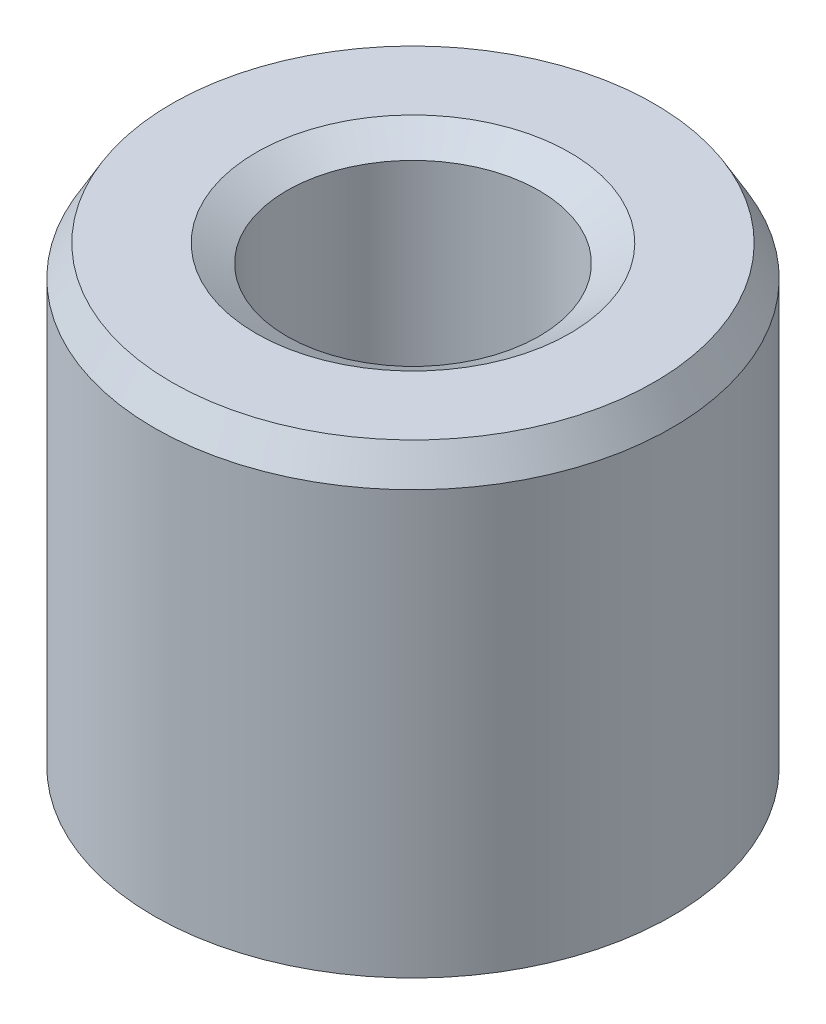
ISO-10303-21;
HEADER;
FILE_DESCRIPTION(('STEP AP214'),'2;1');
FILE_NAME('part.step','',(''),(''),'','','');
FILE_SCHEMA(('AUTOMOTIVE_DESIGN { 1 0 10303 214 1 1 1 1 }'));
ENDSEC;
DATA;
#1=APPLICATION_CONTEXT('core data for automotive mechanical design processes');
#2=APPLICATION_PROTOCOL_DEFINITION('international standard','automotive_design',2000,#1);
#3=PRODUCT_CONTEXT('',#1,'mechanical');
#4=PRODUCT('Part','Part','',(#3));
#5=PRODUCT_RELATED_PRODUCT_CATEGORY('part','',(#4));
#6=PRODUCT_DEFINITION_FORMATION('','',#4);
#7=PRODUCT_DEFINITION_CONTEXT('part definition',#1,'design');
#8=PRODUCT_DEFINITION('design','',#6,#7);
#9=PRODUCT_DEFINITION_SHAPE('','',#8);
#10=(LENGTH_UNIT() NAMED_UNIT(*) SI_UNIT(.MILLI.,.METRE.));
#11=(NAMED_UNIT(*) PLANE_ANGLE_UNIT() SI_UNIT($,.RADIAN.));
#12=(NAMED_UNIT(*) SI_UNIT($,.STERADIAN.) SOLID_ANGLE_UNIT());
#13=UNCERTAINTY_MEASURE_WITH_UNIT(LENGTH_MEASURE(1.E-05),#10,'distance_accuracy_value','');
#14=(GEOMETRIC_REPRESENTATION_CONTEXT(3) GLOBAL_UNCERTAINTY_ASSIGNED_CONTEXT((#13)) GLOBAL_UNIT_ASSIGNED_CONTEXT((#10,
#11,#12)) REPRESENTATION_CONTEXT('',''));
#15=CARTESIAN_POINT('',(0.,0.,0.));
#16=DIRECTION('',(0.,0.,1.));
#17=DIRECTION('',(1.,0.,0.));
#18=AXIS2_PLACEMENT_3D('',#15,#16,#17);
#19=CARTESIAN_POINT('',(0.,40.9386672005299,0.));
#20=DIRECTION('',(0.,-1.,0.));
#21=DIRECTION('',(0.,0.,-1.));
#22=AXIS2_PLACEMENT_3D('',#19,#20,#21);
#23=CYLINDRICAL_SURFACE('',#22,22.5);
#24=CARTESIAN_POINT('',(0.,1.53690710719433,0.));
#25=DIRECTION('',(0.,1.,0.));
#26=DIRECTION('',(0.,0.,1.));
#27=AXIS2_PLACEMENT_3D('',#24,#25,#26);
#28=CIRCLE('',#27,22.5);
#29=CARTESIAN_POINT('',(0.,1.53690710719433,22.5));
#30=VERTEX_POINT('',#29);
#31=EDGE_CURVE('E10',#30,#30,#28,.T.);
#32=ORIENTED_EDGE('',*,*,#31,.T.);
#33=EDGE_LOOP('',(#32));
#34=FACE_BOUND('',#33,.T.);
#35=CARTESIAN_POINT('',(0.,38.2766660043556,0.));
#36=DIRECTION('',(0.,1.,0.));
#37=DIRECTION('',(0.,0.,1.));
#38=AXIS2_PLACEMENT_3D('',#35,#36,#37);
#39=CIRCLE('',#38,22.5);
#40=CARTESIAN_POINT('',(0.,38.2766660043556,22.5));
#41=VERTEX_POINT('',#40);
#42=EDGE_CURVE('E50',#41,#41,#39,.F.);
#43=ORIENTED_EDGE('',*,*,#42,.T.);
#44=EDGE_LOOP('',(#43));
#45=FACE_BOUND('',#44,.T.);
#46=ADVANCED_FACE('F39',(#34,#45),#23,.T.);
#47=CARTESIAN_POINT('',(0.,40.9386672005299,0.));
#48=DIRECTION('',(0.,1.,0.));
#49=DIRECTION('',(0.,0.,1.));
#50=AXIS2_PLACEMENT_3D('',#47,#48,#49);
#51=PLANE('',#50);
#52=CARTESIAN_POINT('',(0.,40.9386672005299,0.));
#53=DIRECTION('',(0.,1.,0.));
#54=DIRECTION('',(0.,0.,1.));
#55=AXIS2_PLACEMENT_3D('',#52,#53,#54);
#56=CIRCLE('',#55,13.6283420454782);
#57=CARTESIAN_POINT('',(0.,40.9386672005299,13.6283420454782));
#58=VERTEX_POINT('',#57);
#59=EDGE_CURVE('E58',#58,#58,#56,.F.);
#60=ORIENTED_EDGE('',*,*,#59,.T.);
#61=EDGE_LOOP('',(#60));
#62=FACE_BOUND('',#61,.T.);
#63=CARTESIAN_POINT('',(0.,40.9386672005299,0.));
#64=DIRECTION('',(0.,1.,0.));
#65=DIRECTION('',(0.,0.,1.));
#66=AXIS2_PLACEMENT_3D('',#63,#64,#65);
#67=CIRCLE('',#66,20.9630928928057);
#68=CARTESIAN_POINT('',(0.,40.9386672005299,20.9630928928057));
#69=VERTEX_POINT('',#68);
#70=EDGE_CURVE('E61',#69,#69,#67,.T.);
#71=ORIENTED_EDGE('',*,*,#70,.T.);
#72=EDGE_LOOP('',(#71));
#73=FACE_BOUND('',#72,.T.);
#74=ADVANCED_FACE('F88',(#62,#73),#51,.T.);
#75=CARTESIAN_POINT('',(0.,0.,0.));
#76=DIRECTION('',(0.,1.,0.));
#77=DIRECTION('',(0.,0.,1.));
#78=AXIS2_PLACEMENT_3D('',#75,#76,#77);
#79=PLANE('',#78);
#80=CARTESIAN_POINT('',(0.,0.,0.));
#81=DIRECTION('',(0.,1.,0.));
#82=DIRECTION('',(0.,0.,1.));
#83=AXIS2_PLACEMENT_3D('',#80,#81,#82);
#84=CIRCLE('',#83,12.5032479564982);
#85=CARTESIAN_POINT('',(0.,0.,12.5032479564982));
#86=VERTEX_POINT('',#85);
#87=EDGE_CURVE('E51',#86,#86,#84,.T.);
#88=ORIENTED_EDGE('',*,*,#87,.T.);
#89=EDGE_LOOP('',(#88));
#90=FACE_BOUND('',#89,.T.);
#91=CARTESIAN_POINT('',(0.,0.,0.));
#92=DIRECTION('',(0.,1.,0.));
#93=DIRECTION('',(0.,0.,1.));
#94=AXIS2_PLACEMENT_3D('',#91,#92,#93);
#95=CIRCLE('',#94,19.8379988038257);
#96=CARTESIAN_POINT('',(0.,0.,19.8379988038257));
#97=VERTEX_POINT('',#96);
#98=EDGE_CURVE('E54',#97,#97,#95,.F.);
#99=ORIENTED_EDGE('',*,*,#98,.T.);
#100=EDGE_LOOP('',(#99));
#101=FACE_BOUND('',#100,.T.);
#102=ADVANCED_FACE('F83',(#90,#101),#79,.F.);
#103=CARTESIAN_POINT('',(0.,40.9386672005299,0.));
#104=DIRECTION('',(0.,-1.,0.));
#105=DIRECTION('',(0.,0.,-1.));
#106=AXIS2_PLACEMENT_3D('',#103,#104,#105);
#107=CYLINDRICAL_SURFACE('',#106,10.9663408493039);
#108=CARTESIAN_POINT('',(0.,39.4017600933356,0.));
#109=DIRECTION('',(0.,1.,0.));
#110=DIRECTION('',(0.,0.,1.));
#111=AXIS2_PLACEMENT_3D('',#108,#109,#110);
#112=CIRCLE('',#111,10.9663408493039);
#113=CARTESIAN_POINT('',(0.,39.4017600933356,10.9663408493039));
#114=VERTEX_POINT('',#113);
#115=EDGE_CURVE('E67',#114,#114,#112,.T.);
#116=ORIENTED_EDGE('',*,*,#115,.T.);
#117=EDGE_LOOP('',(#116));
#118=FACE_BOUND('',#117,.T.);
#119=CARTESIAN_POINT('',(0.,2.66200119617431,0.));
#120=DIRECTION('',(0.,1.,0.));
#121=DIRECTION('',(0.,0.,1.));
#122=AXIS2_PLACEMENT_3D('',#119,#120,#121);
#123=CIRCLE('',#122,10.9663408493039);
#124=CARTESIAN_POINT('',(0.,2.66200119617431,10.9663408493039));
#125=VERTEX_POINT('',#124);
#126=EDGE_CURVE('E69',#125,#125,#123,.F.);
#127=ORIENTED_EDGE('',*,*,#126,.T.);
#128=EDGE_LOOP('',(#127));
#129=FACE_BOUND('',#128,.T.);
#130=ADVANCED_FACE('F71',(#118,#129),#107,.F.);
#131=CARTESIAN_POINT('',(0.,39.4017600933356,0.));
#132=DIRECTION('',(0.,1.,0.));
#133=DIRECTION('',(0.,0.,1.));
#134=AXIS2_PLACEMENT_3D('',#131,#132,#133);
#135=CONICAL_SURFACE('',#134,10.9663408493039,1.0471975511966);
#136=ORIENTED_EDGE('',*,*,#59,.F.);
#137=EDGE_LOOP('',(#136));
#138=FACE_BOUND('',#137,.T.);
#139=ORIENTED_EDGE('',*,*,#115,.F.);
#140=EDGE_LOOP('',(#139));
#141=FACE_BOUND('',#140,.T.);
#142=ADVANCED_FACE('F77',(#138,#141),#135,.F.);
#143=CARTESIAN_POINT('',(0.,0.,0.));
#144=DIRECTION('',(0.,-1.,0.));
#145=DIRECTION('',(0.,0.,-1.));
#146=AXIS2_PLACEMENT_3D('',#143,#144,#145);
#147=CONICAL_SURFACE('',#146,12.5032479564982,0.523598775598295);
#148=ORIENTED_EDGE('',*,*,#126,.F.);
#149=EDGE_LOOP('',(#148));
#150=FACE_BOUND('',#149,.T.);
#151=ORIENTED_EDGE('',*,*,#87,.F.);
#152=EDGE_LOOP('',(#151));
#153=FACE_BOUND('',#152,.T.);
#154=ADVANCED_FACE('F73',(#150,#153),#147,.F.);
#155=CARTESIAN_POINT('',(0.,1.53690710719433,0.));
#156=DIRECTION('',(0.,1.,0.));
#157=DIRECTION('',(0.,0.,1.));
#158=AXIS2_PLACEMENT_3D('',#155,#156,#157);
#159=CONICAL_SURFACE('',#158,22.5,1.0471975511966);
#160=CARTESIAN_POINT('',(0.,0.,19.8379988038257));
#161=CARTESIAN_POINT('',(0.,0.0160094490332744,19.8657279829525));
#162=CARTESIAN_POINT('',(0.,0.0320188980665484,19.8934571620793));
#163=CARTESIAN_POINT('',(0.,0.0640377961330966,19.948915520333));
#164=CARTESIAN_POINT('',(0.,0.0800472451663706,19.9766446994598));
#165=CARTESIAN_POINT('',(0.,0.112066143232919,20.0321030577134));
#166=CARTESIAN_POINT('',(0.,0.128075592266194,20.0598322368402));
#167=CARTESIAN_POINT('',(0.,0.160094490332742,20.1152905950938));
#168=CARTESIAN_POINT('',(0.,0.176103939366016,20.1430197742207));
#169=CARTESIAN_POINT('',(0.,0.208122837432565,20.1984781324743));
#170=CARTESIAN_POINT('',(0.,0.224132286465839,20.2262073116011));
#171=CARTESIAN_POINT('',(0.,0.256151184532388,20.2816656698547));
#172=CARTESIAN_POINT('',(0.,0.272160633565662,20.3093948489816));
#173=CARTESIAN_POINT('',(0.,0.30417953163221,20.3648532072352));
#174=CARTESIAN_POINT('',(0.,0.320188980665484,20.392582386362));
#175=CARTESIAN_POINT('',(0.,0.352207878732033,20.4480407446156));
#176=CARTESIAN_POINT('',(0.,0.368217327765307,20.4757699237425));
#177=CARTESIAN_POINT('',(0.,0.400236225831856,20.5312282819961));
#178=CARTESIAN_POINT('',(0.,0.41624567486513,20.5589574611229));
#179=CARTESIAN_POINT('',(0.,0.448264572931678,20.6144158193765));
#180=CARTESIAN_POINT('',(0.,0.464274021964953,20.6421449985034));
#181=CARTESIAN_POINT('',(0.,0.496292920031501,20.697603356757));
#182=CARTESIAN_POINT('',(0.,0.512302369064775,20.7253325358838));
#183=CARTESIAN_POINT('',(0.,0.544321267131324,20.7807908941374));
#184=CARTESIAN_POINT('',(0.,0.560330716164598,20.8085200732642));
#185=CARTESIAN_POINT('',(0.,0.592349614231147,20.8639784315179));
#186=CARTESIAN_POINT('',(0.,0.608359063264421,20.8917076106447));
#187=CARTESIAN_POINT('',(0.,0.640377961330969,20.9471659688983));
#188=CARTESIAN_POINT('',(0.,0.656387410364243,20.9748951480251));
#189=CARTESIAN_POINT('',(0.,0.688406308430792,21.0303535062788));
#190=CARTESIAN_POINT('',(0.,0.704415757464066,21.0580826854056));
#191=CARTESIAN_POINT('',(0.,0.736434655530615,21.1135410436592));
#192=CARTESIAN_POINT('',(0.,0.752444104563889,21.141270222786));
#193=CARTESIAN_POINT('',(0.,0.784463002630437,21.1967285810397));
#194=CARTESIAN_POINT('',(0.,0.800472451663712,21.2244577601665));
#195=CARTESIAN_POINT('',(0.,0.83249134973026,21.2799161184201));
#196=CARTESIAN_POINT('',(0.,0.848500798763534,21.3076452975469));
#197=CARTESIAN_POINT('',(0.,0.880519696830083,21.3631036558006));
#198=CARTESIAN_POINT('',(0.,0.896529145863357,21.3908328349274));
#199=CARTESIAN_POINT('',(0.,0.928548043929906,21.446291193181));
#200=CARTESIAN_POINT('',(0.,0.94455749296318,21.4740203723078));
#201=CARTESIAN_POINT('',(0.,0.976576391029728,21.5294787305615));
#202=CARTESIAN_POINT('',(0.,0.992585840063003,21.5572079096883));
#203=CARTESIAN_POINT('',(0.,1.02460473812955,21.6126662679419));
#204=CARTESIAN_POINT('',(0.,1.04061418716283,21.6403954470687));
#205=CARTESIAN_POINT('',(0.,1.07263308522937,21.6958538053223));
#206=CARTESIAN_POINT('',(0.,1.08864253426265,21.7235829844492));
#207=CARTESIAN_POINT('',(0.,1.1206614323292,21.7790413427028));
#208=CARTESIAN_POINT('',(0.,1.13667088136247,21.8067705218296));
#209=CARTESIAN_POINT('',(0.,1.16868977942902,21.8622288800832));
#210=CARTESIAN_POINT('',(0.,1.18469922846229,21.8899580592101));
#211=CARTESIAN_POINT('',(0.,1.21671812652884,21.9454164174637));
#212=CARTESIAN_POINT('',(0.,1.23272757556212,21.9731455965905));
#213=CARTESIAN_POINT('',(0.,1.26474647362866,22.0286039548441));
#214=CARTESIAN_POINT('',(0.,1.28075592266194,22.056333133971));
#215=CARTESIAN_POINT('',(0.,1.31277482072849,22.1117914922246));
#216=CARTESIAN_POINT('',(0.,1.32878426976176,22.1395206713514));
#217=CARTESIAN_POINT('',(0.,1.36080316782831,22.194979029605));
#218=CARTESIAN_POINT('',(0.,1.37681261686158,22.2227082087318));
#219=CARTESIAN_POINT('',(0.,1.40883151492813,22.2781665669855));
#220=CARTESIAN_POINT('',(0.,1.42484096396141,22.3058957461123));
#221=CARTESIAN_POINT('',(0.,1.45685986202796,22.3613541043659));
#222=CARTESIAN_POINT('',(0.,1.47286931106123,22.3890832834927));
#223=CARTESIAN_POINT('',(0.,1.50488820912778,22.4445416417464));
#224=CARTESIAN_POINT('',(0.,1.52089765816105,22.4722708208732));
#225=CARTESIAN_POINT('',(0.,1.53690710719433,22.5));
#226=B_SPLINE_CURVE_WITH_KNOTS('',3,(#160,#161,#162,#163,#164,#165,#166,#167,#168,#169,#170,
#171,#172,#173,#174,#175,#176,#177,#178,#179,#180,#181,#182,#183,#184,#185,#186,#187,#188,#189,
#190,#191,#192,#193,#194,#195,#196,#197,#198,#199,#200,#201,#202,#203,#204,#205,#206,#207,#208,
#209,#210,#211,#212,#213,#214,#215,#216,#217,#218,#219,#220,#221,#222,#223,#224,#225),
.UNSPECIFIED.,.F.,.F.,(4,2,2,2,2,2,2,2,2,2,2,2,2,2,2,2,2,2,2,2,2,2,2,2,2,2,2,2,2,2,2,2,4),(0.,
0.0960566941996466,0.192113388399293,0.288170082598937,0.384226776798583,0.48028347099823,
0.576340165197877,0.672396859397523,0.768453553597167,0.864510247796813,0.96056694199646,
1.05662363619611,1.15268033039575,1.2487370245954,1.34479371879505,1.44085041299469,
1.53690710719434,1.63296380139398,1.72902049559363,1.82507718979328,1.92113388399292,
2.01719057819257,2.11324727239221,2.20930396659186,2.30536066079151,2.40141735499115,
2.4974740491908,2.59353074339045,2.68958743759009,2.78564413178974,2.88170082598938,
2.97775752018903,3.07381421438868),.UNSPECIFIED.);
#227=EDGE_CURVE('BSEAM76',#97,#30,#226,.T.);
#228=ORIENTED_EDGE('',*,*,#98,.F.);
#229=ORIENTED_EDGE('',*,*,#31,.F.);
#230=ORIENTED_EDGE('',*,*,#227,.T.);
#231=ORIENTED_EDGE('',*,*,#227,.F.);
#232=EDGE_LOOP('',(#228,#230,#229,#231));
#233=FACE_BOUND('',#232,.T.);
#234=ADVANCED_FACE('F76',(#233),#159,.T.);
#235=CARTESIAN_POINT('',(0.,40.9386672005299,0.));
#236=DIRECTION('',(0.,-1.,0.));
#237=DIRECTION('',(0.,0.,-1.));
#238=AXIS2_PLACEMENT_3D('',#235,#236,#237);
#239=CONICAL_SURFACE('',#238,20.9630928928057,0.523598775598295);
#240=ORIENTED_EDGE('',*,*,#42,.F.);
#241=EDGE_LOOP('',(#240));
#242=FACE_BOUND('',#241,.T.);
#243=ORIENTED_EDGE('',*,*,#70,.F.);
#244=EDGE_LOOP('',(#243));
#245=FACE_BOUND('',#244,.T.);
#246=ADVANCED_FACE('F45',(#242,#245),#239,.T.);
#247=CLOSED_SHELL('',(#46,#74,#102,#130,#142,#154,#234,#246));
#248=MANIFOLD_SOLID_BREP('B2',#247);
#249=ADVANCED_BREP_SHAPE_REPRESENTATION('',(#18,#248),#14);
#250=SHAPE_DEFINITION_REPRESENTATION(#9,#249);
ENDSEC;
END-ISO-10303-21;
